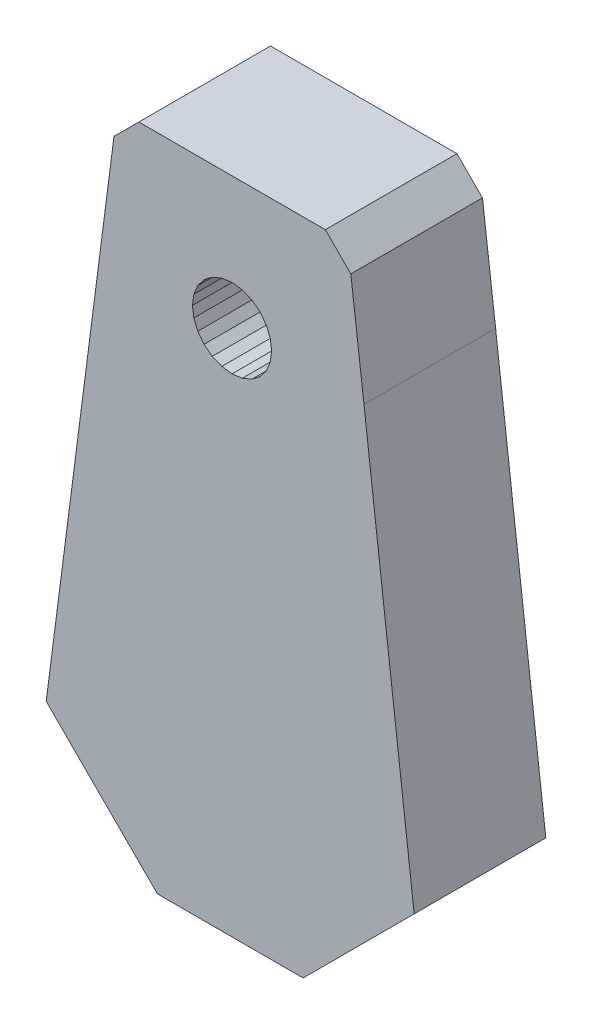
ISO-10303-21;
HEADER;
FILE_DESCRIPTION(('STEP AP214'),'2;1');
FILE_NAME('part.step','',(''),(''),'','','');
FILE_SCHEMA(('AUTOMOTIVE_DESIGN { 1 0 10303 214 1 1 1 1 }'));
ENDSEC;
DATA;
#1=APPLICATION_CONTEXT('core data for automotive mechanical design processes');
#2=APPLICATION_PROTOCOL_DEFINITION('international standard','automotive_design',2000,#1);
#3=PRODUCT_CONTEXT('',#1,'mechanical');
#4=PRODUCT('Part','Part','',(#3));
#5=PRODUCT_RELATED_PRODUCT_CATEGORY('part','',(#4));
#6=PRODUCT_DEFINITION_FORMATION('','',#4);
#7=PRODUCT_DEFINITION_CONTEXT('part definition',#1,'design');
#8=PRODUCT_DEFINITION('design','',#6,#7);
#9=PRODUCT_DEFINITION_SHAPE('','',#8);
#10=(LENGTH_UNIT() NAMED_UNIT(*) SI_UNIT(.MILLI.,.METRE.));
#11=(NAMED_UNIT(*) PLANE_ANGLE_UNIT() SI_UNIT($,.RADIAN.));
#12=(NAMED_UNIT(*) SI_UNIT($,.STERADIAN.) SOLID_ANGLE_UNIT());
#13=UNCERTAINTY_MEASURE_WITH_UNIT(LENGTH_MEASURE(1.E-05),#10,'distance_accuracy_value','');
#14=(GEOMETRIC_REPRESENTATION_CONTEXT(3) GLOBAL_UNCERTAINTY_ASSIGNED_CONTEXT((#13)) GLOBAL_UNIT_ASSIGNED_CONTEXT((#10,
#11,#12)) REPRESENTATION_CONTEXT('',''));
#15=CARTESIAN_POINT('',(0.,0.,0.));
#16=DIRECTION('',(0.,0.,1.));
#17=DIRECTION('',(1.,0.,0.));
#18=AXIS2_PLACEMENT_3D('',#15,#16,#17);
#19=CARTESIAN_POINT('',(301.525287654345,392.955405424548,6.));
#20=DIRECTION('',(0.608761429008561,0.793353340291357,0.));
#21=DIRECTION('',(-0.793353340291358,0.608761429008561,0.));
#22=AXIS2_PLACEMENT_3D('',#19,#20,#21);
#23=PLANE('',#22);
#24=DIRECTION('',(0.793353340291357,-0.608761429008561,0.));
#25=VECTOR('',#24,1.);
#26=CARTESIAN_POINT('',(301.525287654345,392.955405424548,0.));
#27=LINE('',#26,#25);
#28=CARTESIAN_POINT('',(475.222781090889,259.672630966445,0.));
#29=VERTEX_POINT('',#28);
#30=CARTESIAN_POINT('',(475.596410419264,259.385935099283,0.));
#31=VERTEX_POINT('',#30);
#32=EDGE_CURVE('E305',#29,#31,#27,.T.);
#33=ORIENTED_EDGE('',*,*,#32,.T.);
#34=DIRECTION('',(0.,0.,-1.));
#35=VECTOR('',#34,1.);
#36=CARTESIAN_POINT('',(475.596410419264,259.385935099283,6.));
#37=LINE('',#36,#35);
#38=CARTESIAN_POINT('',(475.596410419264,259.385935099283,6.));
#39=VERTEX_POINT('',#38);
#40=EDGE_CURVE('E11',#39,#31,#37,.T.);
#41=ORIENTED_EDGE('',*,*,#40,.F.);
#42=DIRECTION('',(0.793353340291357,-0.608761429008561,0.));
#43=VECTOR('',#42,1.);
#44=CARTESIAN_POINT('',(301.525287654345,392.955405424548,6.));
#45=LINE('',#44,#43);
#46=CARTESIAN_POINT('',(475.222781090889,259.672630966445,6.));
#47=VERTEX_POINT('',#46);
#48=EDGE_CURVE('E490',#47,#39,#45,.T.);
#49=ORIENTED_EDGE('',*,*,#48,.F.);
#50=DIRECTION('',(0.,0.,-1.));
#51=VECTOR('',#50,1.);
#52=CARTESIAN_POINT('',(475.222781090889,259.672630966445,6.));
#53=LINE('',#52,#51);
#54=EDGE_CURVE('E352',#47,#29,#53,.T.);
#55=ORIENTED_EDGE('',*,*,#54,.T.);
#56=EDGE_LOOP('',(#33,#41,#49,#55));
#57=FACE_BOUND('',#56,.T.);
#58=ADVANCED_FACE('F32',(#57),#23,.F.);
#59=CARTESIAN_POINT('',(424.618696453347,325.821385389105,6.));
#60=DIRECTION('',(0.79335334029123,0.608761429008727,0.));
#61=DIRECTION('',(-0.608761429008727,0.79335334029123,0.));
#62=AXIS2_PLACEMENT_3D('',#59,#60,#61);
#63=PLANE('',#62);
#64=DIRECTION('',(0.608761429008727,-0.79335334029123,0.));
#65=VECTOR('',#64,1.);
#66=CARTESIAN_POINT('',(424.618696453347,325.821385389105,0.));
#67=LINE('',#66,#65);
#68=CARTESIAN_POINT('',(475.883106286426,259.012305770908,0.));
#69=VERTEX_POINT('',#68);
#70=EDGE_CURVE('E308',#31,#69,#67,.T.);
#71=ORIENTED_EDGE('',*,*,#70,.T.);
#72=DIRECTION('',(0.,0.,-1.));
#73=VECTOR('',#72,1.);
#74=CARTESIAN_POINT('',(475.883106286426,259.012305770908,6.));
#75=LINE('',#74,#73);
#76=CARTESIAN_POINT('',(475.883106286426,259.012305770908,6.));
#77=VERTEX_POINT('',#76);
#78=EDGE_CURVE('E42',#77,#69,#75,.T.);
#79=ORIENTED_EDGE('',*,*,#78,.F.);
#80=DIRECTION('',(0.608761429008727,-0.79335334029123,0.));
#81=VECTOR('',#80,1.);
#82=CARTESIAN_POINT('',(424.618696453347,325.821385389105,6.));
#83=LINE('',#82,#81);
#84=EDGE_CURVE('E492',#39,#77,#83,.T.);
#85=ORIENTED_EDGE('',*,*,#84,.F.);
#86=ORIENTED_EDGE('',*,*,#40,.T.);
#87=EDGE_LOOP('',(#71,#79,#85,#86));
#88=FACE_BOUND('',#87,.T.);
#89=ADVANCED_FACE('F557',(#88),#63,.F.);
#90=CARTESIAN_POINT('',(497.766317807572,206.181559728233,6.));
#91=DIRECTION('',(0.923879532511405,0.382683432364805,0.));
#92=DIRECTION('',(-0.382683432364805,0.923879532511405,0.));
#93=AXIS2_PLACEMENT_3D('',#90,#91,#92);
#94=PLANE('',#93);
#95=DIRECTION('',(0.382683432364805,-0.923879532511405,0.));
#96=VECTOR('',#95,1.);
#97=CARTESIAN_POINT('',(497.766317807572,206.181559728233,0.));
#98=LINE('',#97,#96);
#99=CARTESIAN_POINT('',(476.063330842817,258.577205202597,0.));
#100=VERTEX_POINT('',#99);
#101=EDGE_CURVE('E310',#69,#100,#98,.T.);
#102=ORIENTED_EDGE('',*,*,#101,.T.);
#103=DIRECTION('',(0.,0.,-1.));
#104=VECTOR('',#103,1.);
#105=CARTESIAN_POINT('',(476.063330842817,258.577205202597,6.));
#106=LINE('',#105,#104);
#107=CARTESIAN_POINT('',(476.063330842817,258.577205202597,6.));
#108=VERTEX_POINT('',#107);
#109=EDGE_CURVE('E407',#108,#100,#106,.T.);
#110=ORIENTED_EDGE('',*,*,#109,.F.);
#111=DIRECTION('',(0.382683432364805,-0.923879532511405,0.));
#112=VECTOR('',#111,1.);
#113=CARTESIAN_POINT('',(497.766317807572,206.181559728233,6.));
#114=LINE('',#113,#112);
#115=EDGE_CURVE('E494',#77,#108,#114,.T.);
#116=ORIENTED_EDGE('',*,*,#115,.F.);
#117=ORIENTED_EDGE('',*,*,#78,.T.);
#118=EDGE_LOOP('',(#102,#110,#116,#117));
#119=FACE_BOUND('',#118,.T.);
#120=ADVANCED_FACE('F562',(#119),#94,.F.);
#121=CARTESIAN_POINT('',(501.414951194474,66.0125306525016,6.));
#122=DIRECTION('',(0.991444861373788,0.13052619222022,0.));
#123=DIRECTION('',(-0.13052619222022,0.991444861373788,0.));
#124=AXIS2_PLACEMENT_3D('',#121,#122,#123);
#125=PLANE('',#124);
#126=DIRECTION('',(0.13052619222022,-0.991444861373788,0.));
#127=VECTOR('',#126,1.);
#128=CARTESIAN_POINT('',(501.414951194474,66.0125306525016,0.));
#129=LINE('',#128,#127);
#130=CARTESIAN_POINT('',(476.124802082752,258.110284779044,0.));
#131=VERTEX_POINT('',#130);
#132=EDGE_CURVE('E312',#100,#131,#129,.T.);
#133=ORIENTED_EDGE('',*,*,#132,.T.);
#134=DIRECTION('',(0.,0.,-1.));
#135=VECTOR('',#134,1.);
#136=CARTESIAN_POINT('',(476.124802082752,258.110284779044,6.));
#137=LINE('',#136,#135);
#138=CARTESIAN_POINT('',(476.124802082752,258.110284779044,6.));
#139=VERTEX_POINT('',#138);
#140=EDGE_CURVE('E404',#139,#131,#137,.T.);
#141=ORIENTED_EDGE('',*,*,#140,.F.);
#142=DIRECTION('',(0.13052619222022,-0.991444861373788,0.));
#143=VECTOR('',#142,1.);
#144=CARTESIAN_POINT('',(501.414951194474,66.0125306525016,6.));
#145=LINE('',#144,#143);
#146=EDGE_CURVE('E496',#108,#139,#145,.T.);
#147=ORIENTED_EDGE('',*,*,#146,.F.);
#148=ORIENTED_EDGE('',*,*,#109,.T.);
#149=EDGE_LOOP('',(#133,#141,#147,#148));
#150=FACE_BOUND('',#149,.T.);
#151=ADVANCED_FACE('F653',(#150),#125,.F.);
#152=CARTESIAN_POINT('',(434.61109375672,-57.2176359723578,6.));
#153=DIRECTION('',(0.991444861373782,-0.130526192220266,0.));
#154=DIRECTION('',(0.130526192220266,0.991444861373782,0.));
#155=AXIS2_PLACEMENT_3D('',#152,#153,#154);
#156=PLANE('',#155);
#157=DIRECTION('',(-0.130526192220266,-0.991444861373782,0.));
#158=VECTOR('',#157,1.);
#159=CARTESIAN_POINT('',(434.61109375672,-57.2176359723578,0.));
#160=LINE('',#159,#158);
#161=CARTESIAN_POINT('',(476.063330842817,257.643364355491,0.));
#162=VERTEX_POINT('',#161);
#163=EDGE_CURVE('E314',#131,#162,#160,.T.);
#164=ORIENTED_EDGE('',*,*,#163,.T.);
#165=DIRECTION('',(0.,0.,-1.));
#166=VECTOR('',#165,1.);
#167=CARTESIAN_POINT('',(476.063330842817,257.643364355491,6.));
#168=LINE('',#167,#166);
#169=CARTESIAN_POINT('',(476.063330842817,257.643364355491,6.));
#170=VERTEX_POINT('',#169);
#171=EDGE_CURVE('E401',#170,#162,#168,.T.);
#172=ORIENTED_EDGE('',*,*,#171,.F.);
#173=DIRECTION('',(-0.130526192220266,-0.991444861373782,0.));
#174=VECTOR('',#173,1.);
#175=CARTESIAN_POINT('',(434.61109375672,-57.2176359723578,6.));
#176=LINE('',#175,#174);
#177=EDGE_CURVE('E498',#139,#170,#176,.T.);
#178=ORIENTED_EDGE('',*,*,#177,.F.);
#179=ORIENTED_EDGE('',*,*,#140,.T.);
#180=EDGE_LOOP('',(#164,#172,#178,#179));
#181=FACE_BOUND('',#180,.T.);
#182=ADVANCED_FACE('F649',(#181),#156,.F.);
#183=CARTESIAN_POINT('',(315.254785146361,-130.582807610575,6.));
#184=DIRECTION('',(0.923879532511353,-0.38268343236493,0.));
#185=DIRECTION('',(0.38268343236493,0.923879532511353,0.));
#186=AXIS2_PLACEMENT_3D('',#183,#184,#185);
#187=PLANE('',#186);
#188=DIRECTION('',(-0.38268343236493,-0.923879532511353,0.));
#189=VECTOR('',#188,1.);
#190=CARTESIAN_POINT('',(315.254785146361,-130.582807610575,0.));
#191=LINE('',#190,#189);
#192=CARTESIAN_POINT('',(475.883106286426,257.208263787181,0.));
#193=VERTEX_POINT('',#192);
#194=EDGE_CURVE('E316',#162,#193,#191,.T.);
#195=ORIENTED_EDGE('',*,*,#194,.T.);
#196=DIRECTION('',(0.,0.,-1.));
#197=VECTOR('',#196,1.);
#198=CARTESIAN_POINT('',(475.883106286426,257.208263787181,6.));
#199=LINE('',#198,#197);
#200=CARTESIAN_POINT('',(475.883106286426,257.208263787181,6.));
#201=VERTEX_POINT('',#200);
#202=EDGE_CURVE('E398',#201,#193,#199,.T.);
#203=ORIENTED_EDGE('',*,*,#202,.F.);
#204=DIRECTION('',(-0.38268343236493,-0.923879532511353,0.));
#205=VECTOR('',#204,1.);
#206=CARTESIAN_POINT('',(315.254785146361,-130.582807610575,6.));
#207=LINE('',#206,#205);
#208=EDGE_CURVE('E500',#170,#201,#207,.T.);
#209=ORIENTED_EDGE('',*,*,#208,.F.);
#210=ORIENTED_EDGE('',*,*,#171,.T.);
#211=EDGE_LOOP('',(#195,#203,#209,#210));
#212=FACE_BOUND('',#211,.T.);
#213=ADVANCED_FACE('F645',(#212),#187,.F.);
#214=CARTESIAN_POINT('',(175.303306354366,-134.514958047691,6.));
#215=DIRECTION('',(0.793353340291143,-0.608761429008841,0.));
#216=DIRECTION('',(0.608761429008841,0.793353340291143,0.));
#217=AXIS2_PLACEMENT_3D('',#214,#215,#216);
#218=PLANE('',#217);
#219=DIRECTION('',(-0.608761429008841,-0.793353340291143,0.));
#220=VECTOR('',#219,1.);
#221=CARTESIAN_POINT('',(175.303306354366,-134.514958047691,0.));
#222=LINE('',#221,#220);
#223=CARTESIAN_POINT('',(475.596410419264,256.834634458806,0.));
#224=VERTEX_POINT('',#223);
#225=EDGE_CURVE('E318',#193,#224,#222,.T.);
#226=ORIENTED_EDGE('',*,*,#225,.T.);
#227=DIRECTION('',(0.,0.,-1.));
#228=VECTOR('',#227,1.);
#229=CARTESIAN_POINT('',(475.596410419264,256.834634458806,6.));
#230=LINE('',#229,#228);
#231=CARTESIAN_POINT('',(475.596410419264,256.834634458806,6.));
#232=VERTEX_POINT('',#231);
#233=EDGE_CURVE('E395',#232,#224,#230,.T.);
#234=ORIENTED_EDGE('',*,*,#233,.F.);
#235=DIRECTION('',(-0.608761429008841,-0.793353340291143,0.));
#236=VECTOR('',#235,1.);
#237=CARTESIAN_POINT('',(175.303306354366,-134.514958047691,6.));
#238=LINE('',#237,#236);
#239=EDGE_CURVE('E502',#201,#232,#238,.T.);
#240=ORIENTED_EDGE('',*,*,#239,.F.);
#241=ORIENTED_EDGE('',*,*,#202,.T.);
#242=EDGE_LOOP('',(#226,#234,#240,#241));
#243=FACE_BOUND('',#242,.T.);
#244=ADVANCED_FACE('F641',(#243),#218,.F.);
#245=CARTESIAN_POINT('',(52.2098975555397,-68.0412632078213,6.));
#246=DIRECTION('',(0.60876142900871,-0.793353340291243,0.));
#247=DIRECTION('',(0.793353340291243,0.60876142900871,0.));
#248=AXIS2_PLACEMENT_3D('',#245,#246,#247);
#249=PLANE('',#248);
#250=DIRECTION('',(-0.793353340291243,-0.60876142900871,0.));
#251=VECTOR('',#250,1.);
#252=CARTESIAN_POINT('',(52.2098975555397,-68.0412632078213,0.));
#253=LINE('',#252,#251);
#254=CARTESIAN_POINT('',(475.222781090889,256.547938591644,0.));
#255=VERTEX_POINT('',#254);
#256=EDGE_CURVE('E320',#224,#255,#253,.T.);
#257=ORIENTED_EDGE('',*,*,#256,.T.);
#258=DIRECTION('',(0.,0.,-1.));
#259=VECTOR('',#258,1.);
#260=CARTESIAN_POINT('',(475.222781090889,256.547938591644,6.));
#261=LINE('',#260,#259);
#262=CARTESIAN_POINT('',(475.222781090889,256.547938591644,6.));
#263=VERTEX_POINT('',#262);
#264=EDGE_CURVE('E392',#263,#255,#261,.T.);
#265=ORIENTED_EDGE('',*,*,#264,.F.);
#266=DIRECTION('',(-0.793353340291243,-0.60876142900871,0.));
#267=VECTOR('',#266,1.);
#268=CARTESIAN_POINT('',(52.2098975555397,-68.0412632078213,6.));
#269=LINE('',#268,#267);
#270=EDGE_CURVE('E504',#232,#263,#269,.T.);
#271=ORIENTED_EDGE('',*,*,#270,.F.);
#272=ORIENTED_EDGE('',*,*,#233,.T.);
#273=EDGE_LOOP('',(#257,#265,#271,#272));
#274=FACE_BOUND('',#273,.T.);
#275=ADVANCED_FACE('F637',(#274),#249,.F.);
#276=CARTESIAN_POINT('',(-21.1086285351643,50.9607372926606,6.));
#277=DIRECTION('',(0.382683432365274,-0.923879532511211,0.));
#278=DIRECTION('',(0.923879532511211,0.382683432365274,0.));
#279=AXIS2_PLACEMENT_3D('',#276,#277,#278);
#280=PLANE('',#279);
#281=DIRECTION('',(-0.923879532511211,-0.382683432365274,0.));
#282=VECTOR('',#281,1.);
#283=CARTESIAN_POINT('',(-21.1086285351643,50.9607372926606,0.));
#284=LINE('',#283,#282);
#285=CARTESIAN_POINT('',(474.787680522578,256.367714035253,0.));
#286=VERTEX_POINT('',#285);
#287=EDGE_CURVE('E322',#255,#286,#284,.T.);
#288=ORIENTED_EDGE('',*,*,#287,.T.);
#289=DIRECTION('',(0.,0.,-1.));
#290=VECTOR('',#289,1.);
#291=CARTESIAN_POINT('',(474.787680522578,256.367714035253,6.));
#292=LINE('',#291,#290);
#293=CARTESIAN_POINT('',(474.787680522578,256.367714035253,6.));
#294=VERTEX_POINT('',#293);
#295=EDGE_CURVE('E389',#294,#286,#292,.T.);
#296=ORIENTED_EDGE('',*,*,#295,.F.);
#297=DIRECTION('',(-0.923879532511211,-0.382683432365274,0.));
#298=VECTOR('',#297,1.);
#299=CARTESIAN_POINT('',(-21.1086285351643,50.9607372926606,6.));
#300=LINE('',#299,#298);
#301=EDGE_CURVE('E506',#263,#294,#300,.T.);
#302=ORIENTED_EDGE('',*,*,#301,.F.);
#303=ORIENTED_EDGE('',*,*,#264,.T.);
#304=EDGE_LOOP('',(#288,#296,#302,#303));
#305=FACE_BOUND('',#304,.T.);
#306=ADVANCED_FACE('F633',(#305),#280,.F.);
#307=CARTESIAN_POINT('',(-25.0874245198946,190.557907974638,6.));
#308=DIRECTION('',(0.130526192220074,-0.991444861373807,0.));
#309=DIRECTION('',(0.991444861373807,0.130526192220074,0.));
#310=AXIS2_PLACEMENT_3D('',#307,#308,#309);
#311=PLANE('',#310);
#312=DIRECTION('',(-0.991444861373808,-0.130526192220074,0.));
#313=VECTOR('',#312,1.);
#314=CARTESIAN_POINT('',(-25.0874245198946,190.557907974638,0.));
#315=LINE('',#314,#313);
#316=CARTESIAN_POINT('',(474.320760099025,256.306242795318,0.));
#317=VERTEX_POINT('',#316);
#318=EDGE_CURVE('E324',#286,#317,#315,.T.);
#319=ORIENTED_EDGE('',*,*,#318,.T.);
#320=DIRECTION('',(0.,0.,-1.));
#321=VECTOR('',#320,1.);
#322=CARTESIAN_POINT('',(474.320760099025,256.306242795318,6.));
#323=LINE('',#322,#321);
#324=CARTESIAN_POINT('',(474.320760099025,256.306242795318,6.));
#325=VERTEX_POINT('',#324);
#326=EDGE_CURVE('E386',#325,#317,#323,.T.);
#327=ORIENTED_EDGE('',*,*,#326,.F.);
#328=DIRECTION('',(-0.991444861373808,-0.130526192220074,0.));
#329=VECTOR('',#328,1.);
#330=CARTESIAN_POINT('',(-25.0874245198946,190.557907974638,6.));
#331=LINE('',#330,#329);
#332=EDGE_CURVE('E508',#294,#325,#331,.T.);
#333=ORIENTED_EDGE('',*,*,#332,.F.);
#334=ORIENTED_EDGE('',*,*,#295,.T.);
#335=EDGE_LOOP('',(#319,#327,#333,#334));
#336=FACE_BOUND('',#335,.T.);
#337=ADVANCED_FACE('F629',(#336),#311,.F.);
#338=CARTESIAN_POINT('',(41.2495124942156,313.32115417579,6.));
#339=DIRECTION('',(-0.130526192220074,-0.991444861373807,0.));
#340=DIRECTION('',(0.991444861373807,-0.130526192220074,0.));
#341=AXIS2_PLACEMENT_3D('',#338,#339,#340);
#342=PLANE('',#341);
#343=DIRECTION('',(-0.991444861373808,0.130526192220074,0.));
#344=VECTOR('',#343,1.);
#345=CARTESIAN_POINT('',(41.2495124942156,313.32115417579,0.));
#346=LINE('',#345,#344);
#347=CARTESIAN_POINT('',(473.853839675472,256.367714035253,0.));
#348=VERTEX_POINT('',#347);
#349=EDGE_CURVE('E326',#317,#348,#346,.T.);
#350=ORIENTED_EDGE('',*,*,#349,.T.);
#351=DIRECTION('',(0.,0.,-1.));
#352=VECTOR('',#351,1.);
#353=CARTESIAN_POINT('',(473.853839675472,256.367714035253,6.));
#354=LINE('',#353,#352);
#355=CARTESIAN_POINT('',(473.853839675472,256.367714035253,6.));
#356=VERTEX_POINT('',#355);
#357=EDGE_CURVE('E383',#356,#348,#354,.T.);
#358=ORIENTED_EDGE('',*,*,#357,.F.);
#359=DIRECTION('',(-0.991444861373808,0.130526192220074,0.));
#360=VECTOR('',#359,1.);
#361=CARTESIAN_POINT('',(41.2495124942156,313.32115417579,6.));
#362=LINE('',#361,#360);
#363=EDGE_CURVE('E510',#325,#356,#362,.T.);
#364=ORIENTED_EDGE('',*,*,#363,.F.);
#365=ORIENTED_EDGE('',*,*,#326,.T.);
#366=EDGE_LOOP('',(#350,#358,#364,#365));
#367=FACE_BOUND('',#366,.T.);
#368=ADVANCED_FACE('F625',(#367),#342,.F.);
#369=CARTESIAN_POINT('',(160.033962710814,386.356163216393,6.));
#370=DIRECTION('',(-0.382683432365399,-0.923879532511159,0.));
#371=DIRECTION('',(0.923879532511159,-0.382683432365399,0.));
#372=AXIS2_PLACEMENT_3D('',#369,#370,#371);
#373=PLANE('',#372);
#374=DIRECTION('',(-0.923879532511159,0.382683432365399,0.));
#375=VECTOR('',#374,1.);
#376=CARTESIAN_POINT('',(160.033962710814,386.356163216393,0.));
#377=LINE('',#376,#375);
#378=CARTESIAN_POINT('',(473.418739107162,256.547938591644,0.));
#379=VERTEX_POINT('',#378);
#380=EDGE_CURVE('E328',#348,#379,#377,.T.);
#381=ORIENTED_EDGE('',*,*,#380,.T.);
#382=DIRECTION('',(0.,0.,-1.));
#383=VECTOR('',#382,1.);
#384=CARTESIAN_POINT('',(473.418739107162,256.547938591644,6.));
#385=LINE('',#384,#383);
#386=CARTESIAN_POINT('',(473.418739107162,256.547938591644,6.));
#387=VERTEX_POINT('',#386);
#388=EDGE_CURVE('E380',#387,#379,#385,.T.);
#389=ORIENTED_EDGE('',*,*,#388,.F.);
#390=DIRECTION('',(-0.923879532511159,0.382683432365399,0.));
#391=VECTOR('',#390,1.);
#392=CARTESIAN_POINT('',(160.033962710814,386.356163216393,6.));
#393=LINE('',#392,#391);
#394=EDGE_CURVE('E512',#356,#387,#393,.T.);
#395=ORIENTED_EDGE('',*,*,#394,.F.);
#396=ORIENTED_EDGE('',*,*,#357,.T.);
#397=EDGE_LOOP('',(#381,#389,#395,#396));
#398=FACE_BOUND('',#397,.T.);
#399=ADVANCED_FACE('F621',(#398),#373,.F.);
#400=CARTESIAN_POINT('',(299.347616342266,390.117408916903,6.));
#401=DIRECTION('',(-0.608761429008596,-0.793353340291331,0.));
#402=DIRECTION('',(0.793353340291331,-0.608761429008596,0.));
#403=AXIS2_PLACEMENT_3D('',#400,#401,#402);
#404=PLANE('',#403);
#405=DIRECTION('',(-0.793353340291331,0.608761429008596,0.));
#406=VECTOR('',#405,1.);
#407=CARTESIAN_POINT('',(299.347616342266,390.117408916903,0.));
#408=LINE('',#407,#406);
#409=CARTESIAN_POINT('',(473.045109778787,256.834634458806,0.));
#410=VERTEX_POINT('',#409);
#411=EDGE_CURVE('E330',#379,#410,#408,.T.);
#412=ORIENTED_EDGE('',*,*,#411,.T.);
#413=DIRECTION('',(0.,0.,-1.));
#414=VECTOR('',#413,1.);
#415=CARTESIAN_POINT('',(473.045109778787,256.834634458806,6.));
#416=LINE('',#415,#414);
#417=CARTESIAN_POINT('',(473.045109778787,256.834634458806,6.));
#418=VERTEX_POINT('',#417);
#419=EDGE_CURVE('E377',#418,#410,#416,.T.);
#420=ORIENTED_EDGE('',*,*,#419,.F.);
#421=DIRECTION('',(-0.793353340291331,0.608761429008596,0.));
#422=VECTOR('',#421,1.);
#423=CARTESIAN_POINT('',(299.347616342266,390.117408916903,6.));
#424=LINE('',#423,#422);
#425=EDGE_CURVE('E514',#387,#418,#424,.T.);
#426=ORIENTED_EDGE('',*,*,#425,.F.);
#427=ORIENTED_EDGE('',*,*,#388,.T.);
#428=EDGE_LOOP('',(#412,#420,#426,#427));
#429=FACE_BOUND('',#428,.T.);
#430=ADVANCED_FACE('F617',(#429),#404,.F.);
#431=CARTESIAN_POINT('',(421.780699945646,323.643714077062,6.));
#432=DIRECTION('',(-0.793353340291133,-0.608761429008853,0.));
#433=DIRECTION('',(0.608761429008853,-0.793353340291134,0.));
#434=AXIS2_PLACEMENT_3D('',#431,#432,#433);
#435=PLANE('',#434);
#436=DIRECTION('',(-0.608761429008853,0.793353340291134,0.));
#437=VECTOR('',#436,1.);
#438=CARTESIAN_POINT('',(421.780699945646,323.643714077062,0.));
#439=LINE('',#438,#437);
#440=CARTESIAN_POINT('',(472.758413911624,257.208263787181,0.));
#441=VERTEX_POINT('',#440);
#442=EDGE_CURVE('E332',#410,#441,#439,.T.);
#443=ORIENTED_EDGE('',*,*,#442,.T.);
#444=DIRECTION('',(0.,0.,-1.));
#445=VECTOR('',#444,1.);
#446=CARTESIAN_POINT('',(472.758413911624,257.208263787181,6.));
#447=LINE('',#446,#445);
#448=CARTESIAN_POINT('',(472.758413911624,257.208263787181,6.));
#449=VERTEX_POINT('',#448);
#450=EDGE_CURVE('E374',#449,#441,#447,.T.);
#451=ORIENTED_EDGE('',*,*,#450,.F.);
#452=DIRECTION('',(-0.608761429008853,0.793353340291134,0.));
#453=VECTOR('',#452,1.);
#454=CARTESIAN_POINT('',(421.780699945646,323.643714077062,6.));
#455=LINE('',#454,#453);
#456=EDGE_CURVE('E516',#418,#449,#455,.T.);
#457=ORIENTED_EDGE('',*,*,#456,.F.);
#458=ORIENTED_EDGE('',*,*,#419,.T.);
#459=EDGE_LOOP('',(#443,#451,#457,#458));
#460=FACE_BOUND('',#459,.T.);
#461=ADVANCED_FACE('F613',(#460),#435,.F.);
#462=CARTESIAN_POINT('',(494.46140087639,204.812618312779,6.));
#463=DIRECTION('',(-0.923879532511433,-0.382683432364736,0.));
#464=DIRECTION('',(0.382683432364736,-0.923879532511433,0.));
#465=AXIS2_PLACEMENT_3D('',#462,#463,#464);
#466=PLANE('',#465);
#467=DIRECTION('',(-0.382683432364736,0.923879532511433,0.));
#468=VECTOR('',#467,1.);
#469=CARTESIAN_POINT('',(494.46140087639,204.812618312779,0.));
#470=LINE('',#469,#468);
#471=CARTESIAN_POINT('',(472.578189355234,257.643364355491,0.));
#472=VERTEX_POINT('',#471);
#473=EDGE_CURVE('E334',#441,#472,#470,.T.);
#474=ORIENTED_EDGE('',*,*,#473,.T.);
#475=DIRECTION('',(0.,0.,-1.));
#476=VECTOR('',#475,1.);
#477=CARTESIAN_POINT('',(472.578189355234,257.643364355491,6.));
#478=LINE('',#477,#476);
#479=CARTESIAN_POINT('',(472.578189355234,257.643364355491,6.));
#480=VERTEX_POINT('',#479);
#481=EDGE_CURVE('E371',#480,#472,#478,.T.);
#482=ORIENTED_EDGE('',*,*,#481,.F.);
#483=DIRECTION('',(-0.382683432364736,0.923879532511433,0.));
#484=VECTOR('',#483,1.);
#485=CARTESIAN_POINT('',(494.46140087639,204.812618312779,6.));
#486=LINE('',#485,#484);
#487=EDGE_CURVE('E518',#449,#480,#486,.T.);
#488=ORIENTED_EDGE('',*,*,#487,.F.);
#489=ORIENTED_EDGE('',*,*,#450,.T.);
#490=EDGE_LOOP('',(#474,#482,#488,#489));
#491=FACE_BOUND('',#490,.T.);
#492=ADVANCED_FACE('F609',(#491),#466,.F.);
#493=CARTESIAN_POINT('',(497.868338466932,65.5456102288499,6.));
#494=DIRECTION('',(-0.991444861373812,-0.130526192220034,0.));
#495=DIRECTION('',(0.130526192220035,-0.991444861373813,0.));
#496=AXIS2_PLACEMENT_3D('',#493,#494,#495);
#497=PLANE('',#496);
#498=DIRECTION('',(-0.130526192220035,0.991444861373813,0.));
#499=VECTOR('',#498,1.);
#500=CARTESIAN_POINT('',(497.868338466932,65.5456102288499,0.));
#501=LINE('',#500,#499);
#502=CARTESIAN_POINT('',(472.516718115299,258.110284779044,0.));
#503=VERTEX_POINT('',#502);
#504=EDGE_CURVE('E336',#472,#503,#501,.T.);
#505=ORIENTED_EDGE('',*,*,#504,.T.);
#506=DIRECTION('',(0.,0.,-1.));
#507=VECTOR('',#506,1.);
#508=CARTESIAN_POINT('',(472.516718115299,258.110284779044,6.));
#509=LINE('',#508,#507);
#510=CARTESIAN_POINT('',(472.516718115299,258.110284779044,6.));
#511=VERTEX_POINT('',#510);
#512=EDGE_CURVE('E368',#511,#503,#509,.T.);
#513=ORIENTED_EDGE('',*,*,#512,.F.);
#514=DIRECTION('',(-0.130526192220035,0.991444861373813,0.));
#515=VECTOR('',#514,1.);
#516=CARTESIAN_POINT('',(497.868338466932,65.5456102288499,6.));
#517=LINE('',#516,#515);
#518=EDGE_CURVE('E520',#480,#511,#517,.T.);
#519=ORIENTED_EDGE('',*,*,#518,.F.);
#520=ORIENTED_EDGE('',*,*,#481,.T.);
#521=EDGE_LOOP('',(#505,#513,#519,#520));
#522=FACE_BOUND('',#521,.T.);
#523=ADVANCED_FACE('F605',(#522),#497,.F.);
#524=CARTESIAN_POINT('',(431.064481029341,-56.750715548659,6.));
#525=DIRECTION('',(-0.991444861373831,0.130526192219897,0.));
#526=DIRECTION('',(-0.130526192219897,-0.991444861373831,0.));
#527=AXIS2_PLACEMENT_3D('',#524,#525,#526);
#528=PLANE('',#527);
#529=DIRECTION('',(0.130526192219897,0.991444861373831,0.));
#530=VECTOR('',#529,1.);
#531=CARTESIAN_POINT('',(431.064481029341,-56.750715548659,0.));
#532=LINE('',#531,#530);
#533=CARTESIAN_POINT('',(472.578189355234,258.577205202597,0.));
#534=VERTEX_POINT('',#533);
#535=EDGE_CURVE('E338',#503,#534,#532,.T.);
#536=ORIENTED_EDGE('',*,*,#535,.T.);
#537=DIRECTION('',(0.,0.,-1.));
#538=VECTOR('',#537,1.);
#539=CARTESIAN_POINT('',(472.578189355234,258.577205202597,6.));
#540=LINE('',#539,#538);
#541=CARTESIAN_POINT('',(472.578189355234,258.577205202597,6.));
#542=VERTEX_POINT('',#541);
#543=EDGE_CURVE('E365',#542,#534,#540,.T.);
#544=ORIENTED_EDGE('',*,*,#543,.F.);
#545=DIRECTION('',(0.130526192219897,0.991444861373831,0.));
#546=VECTOR('',#545,1.);
#547=CARTESIAN_POINT('',(431.064481029341,-56.750715548659,6.));
#548=LINE('',#547,#546);
#549=EDGE_CURVE('E522',#511,#542,#548,.T.);
#550=ORIENTED_EDGE('',*,*,#549,.F.);
#551=ORIENTED_EDGE('',*,*,#512,.T.);
#552=EDGE_LOOP('',(#536,#544,#550,#551));
#553=FACE_BOUND('',#552,.T.);
#554=ADVANCED_FACE('F601',(#553),#528,.F.);
#555=CARTESIAN_POINT('',(311.949868215324,-129.213866195114,6.));
#556=DIRECTION('',(-0.923879532511468,0.382683432364653,0.));
#557=DIRECTION('',(-0.382683432364653,-0.923879532511468,0.));
#558=AXIS2_PLACEMENT_3D('',#555,#556,#557);
#559=PLANE('',#558);
#560=DIRECTION('',(0.382683432364653,0.923879532511468,0.));
#561=VECTOR('',#560,1.);
#562=CARTESIAN_POINT('',(311.949868215324,-129.213866195114,0.));
#563=LINE('',#562,#561);
#564=CARTESIAN_POINT('',(472.758413911624,259.012305770908,0.));
#565=VERTEX_POINT('',#564);
#566=EDGE_CURVE('E340',#534,#565,#563,.T.);
#567=ORIENTED_EDGE('',*,*,#566,.T.);
#568=DIRECTION('',(0.,0.,-1.));
#569=VECTOR('',#568,1.);
#570=CARTESIAN_POINT('',(472.758413911624,259.012305770908,6.));
#571=LINE('',#570,#569);
#572=CARTESIAN_POINT('',(472.758413911624,259.012305770908,6.));
#573=VERTEX_POINT('',#572);
#574=EDGE_CURVE('E362',#573,#565,#571,.T.);
#575=ORIENTED_EDGE('',*,*,#574,.F.);
#576=DIRECTION('',(0.382683432364653,0.923879532511468,0.));
#577=VECTOR('',#576,1.);
#578=CARTESIAN_POINT('',(311.949868215324,-129.213866195114,6.));
#579=LINE('',#578,#577);
#580=EDGE_CURVE('E524',#542,#573,#579,.T.);
#581=ORIENTED_EDGE('',*,*,#580,.F.);
#582=ORIENTED_EDGE('',*,*,#543,.T.);
#583=EDGE_LOOP('',(#567,#575,#581,#582));
#584=FACE_BOUND('',#583,.T.);
#585=ADVANCED_FACE('F597',(#584),#559,.F.);
#586=CARTESIAN_POINT('',(172.465309846606,-132.337286735559,6.));
#587=DIRECTION('',(-0.793353340291002,0.608761429009024,0.));
#588=DIRECTION('',(-0.608761429009024,-0.793353340291003,0.));
#589=AXIS2_PLACEMENT_3D('',#586,#587,#588);
#590=PLANE('',#589);
#591=DIRECTION('',(0.608761429009024,0.793353340291003,0.));
#592=VECTOR('',#591,1.);
#593=CARTESIAN_POINT('',(172.465309846606,-132.337286735559,0.));
#594=LINE('',#593,#592);
#595=CARTESIAN_POINT('',(473.045109778787,259.385935099283,0.));
#596=VERTEX_POINT('',#595);
#597=EDGE_CURVE('E342',#565,#596,#594,.T.);
#598=ORIENTED_EDGE('',*,*,#597,.T.);
#599=DIRECTION('',(0.,0.,-1.));
#600=VECTOR('',#599,1.);
#601=CARTESIAN_POINT('',(473.045109778787,259.385935099283,6.));
#602=LINE('',#601,#600);
#603=CARTESIAN_POINT('',(473.045109778787,259.385935099283,6.));
#604=VERTEX_POINT('',#603);
#605=EDGE_CURVE('E359',#604,#596,#602,.T.);
#606=ORIENTED_EDGE('',*,*,#605,.F.);
#607=DIRECTION('',(0.608761429009024,0.793353340291003,0.));
#608=VECTOR('',#607,1.);
#609=CARTESIAN_POINT('',(172.465309846606,-132.337286735559,6.));
#610=LINE('',#609,#608);
#611=EDGE_CURVE('E526',#573,#604,#610,.T.);
#612=ORIENTED_EDGE('',*,*,#611,.F.);
#613=ORIENTED_EDGE('',*,*,#574,.T.);
#614=EDGE_LOOP('',(#598,#606,#612,#613));
#615=FACE_BOUND('',#614,.T.);
#616=ADVANCED_FACE('F594',(#615),#590,.F.);
#617=CARTESIAN_POINT('',(50.0322262433093,-65.2032667000588,6.));
#618=DIRECTION('',(-0.608761429008448,0.793353340291445,0.));
#619=DIRECTION('',(-0.793353340291445,-0.608761429008448,0.));
#620=AXIS2_PLACEMENT_3D('',#617,#618,#619);
#621=PLANE('',#620);
#622=DIRECTION('',(0.793353340291445,0.608761429008448,0.));
#623=VECTOR('',#622,1.);
#624=CARTESIAN_POINT('',(50.0322262433093,-65.2032667000588,0.));
#625=LINE('',#624,#623);
#626=CARTESIAN_POINT('',(473.418739107162,259.672630966445,0.));
#627=VERTEX_POINT('',#626);
#628=EDGE_CURVE('E344',#596,#627,#625,.T.);
#629=ORIENTED_EDGE('',*,*,#628,.T.);
#630=DIRECTION('',(0.,0.,-1.));
#631=VECTOR('',#630,1.);
#632=CARTESIAN_POINT('',(473.418739107162,259.672630966445,6.));
#633=LINE('',#632,#631);
#634=CARTESIAN_POINT('',(473.418739107162,259.672630966445,6.));
#635=VERTEX_POINT('',#634);
#636=EDGE_CURVE('E356',#635,#627,#633,.T.);
#637=ORIENTED_EDGE('',*,*,#636,.F.);
#638=DIRECTION('',(0.793353340291445,0.608761429008448,0.));
#639=VECTOR('',#638,1.);
#640=CARTESIAN_POINT('',(50.0322262433093,-65.2032667000588,6.));
#641=LINE('',#640,#639);
#642=EDGE_CURVE('E528',#604,#635,#641,.T.);
#643=ORIENTED_EDGE('',*,*,#642,.F.);
#644=ORIENTED_EDGE('',*,*,#605,.T.);
#645=EDGE_LOOP('',(#629,#637,#643,#644));
#646=FACE_BOUND('',#645,.T.);
#647=ADVANCED_FACE('F534',(#646),#621,.F.);
#648=CARTESIAN_POINT('',(-22.4775699506101,54.2656542239516,6.));
#649=DIRECTION('',(-0.382683432365097,0.923879532511284,0.));
#650=DIRECTION('',(-0.923879532511284,-0.382683432365097,0.));
#651=AXIS2_PLACEMENT_3D('',#648,#649,#650);
#652=PLANE('',#651);
#653=DIRECTION('',(0.923879532511284,0.382683432365097,0.));
#654=VECTOR('',#653,1.);
#655=CARTESIAN_POINT('',(-22.4775699506101,54.2656542239516,0.));
#656=LINE('',#655,#654);
#657=CARTESIAN_POINT('',(473.853839675472,259.852855522836,0.));
#658=VERTEX_POINT('',#657);
#659=EDGE_CURVE('E346',#627,#658,#656,.T.);
#660=ORIENTED_EDGE('',*,*,#659,.T.);
#661=DIRECTION('',(0.,0.,-1.));
#662=VECTOR('',#661,1.);
#663=CARTESIAN_POINT('',(473.853839675472,259.852855522836,6.));
#664=LINE('',#663,#662);
#665=CARTESIAN_POINT('',(473.853839675472,259.852855522836,6.));
#666=VERTEX_POINT('',#665);
#667=EDGE_CURVE('E273',#666,#658,#664,.T.);
#668=ORIENTED_EDGE('',*,*,#667,.F.);
#669=DIRECTION('',(0.923879532511284,0.382683432365097,0.));
#670=VECTOR('',#669,1.);
#671=CARTESIAN_POINT('',(-22.4775699506101,54.2656542239516,6.));
#672=LINE('',#671,#670);
#673=EDGE_CURVE('E264',#635,#666,#672,.T.);
#674=ORIENTED_EDGE('',*,*,#673,.F.);
#675=ORIENTED_EDGE('',*,*,#636,.T.);
#676=EDGE_LOOP('',(#660,#668,#674,#675));
#677=FACE_BOUND('',#676,.T.);
#678=ADVANCED_FACE('F538',(#677),#652,.F.);
#679=CARTESIAN_POINT('',(-25.5543449434627,194.104520702095,6.));
#680=DIRECTION('',(-0.13052619222019,0.991444861373792,0.));
#681=DIRECTION('',(-0.991444861373792,-0.13052619222019,0.));
#682=AXIS2_PLACEMENT_3D('',#679,#680,#681);
#683=PLANE('',#682);
#684=DIRECTION('',(0.991444861373792,0.13052619222019,0.));
#685=VECTOR('',#684,1.);
#686=CARTESIAN_POINT('',(-25.5543449434627,194.104520702095,0.));
#687=LINE('',#686,#685);
#688=CARTESIAN_POINT('',(474.320760099025,259.914326762771,0.));
#689=VERTEX_POINT('',#688);
#690=EDGE_CURVE('E272',#658,#689,#687,.T.);
#691=ORIENTED_EDGE('',*,*,#690,.T.);
#692=DIRECTION('',(0.,0.,-1.));
#693=VECTOR('',#692,1.);
#694=CARTESIAN_POINT('',(474.320760099025,259.914326762771,6.));
#695=LINE('',#694,#693);
#696=CARTESIAN_POINT('',(474.320760099025,259.914326762771,6.));
#697=VERTEX_POINT('',#696);
#698=EDGE_CURVE('E269',#697,#689,#695,.T.);
#699=ORIENTED_EDGE('',*,*,#698,.F.);
#700=DIRECTION('',(0.991444861373792,0.13052619222019,0.));
#701=VECTOR('',#700,1.);
#702=CARTESIAN_POINT('',(-25.5543449434627,194.104520702095,6.));
#703=LINE('',#702,#701);
#704=EDGE_CURVE('E258',#666,#697,#703,.T.);
#705=ORIENTED_EDGE('',*,*,#704,.F.);
#706=ORIENTED_EDGE('',*,*,#667,.T.);
#707=EDGE_LOOP('',(#691,#699,#705,#706));
#708=FACE_BOUND('',#707,.T.);
#709=ADVANCED_FACE('F270',(#708),#683,.F.);
#710=CARTESIAN_POINT('',(41.7164329178123,316.867766903354,6.));
#711=DIRECTION('',(0.13052619222019,0.991444861373792,0.));
#712=DIRECTION('',(-0.991444861373792,0.13052619222019,0.));
#713=AXIS2_PLACEMENT_3D('',#710,#711,#712);
#714=PLANE('',#713);
#715=DIRECTION('',(0.991444861373792,-0.13052619222019,0.));
#716=VECTOR('',#715,1.);
#717=CARTESIAN_POINT('',(41.7164329178123,316.867766903354,0.));
#718=LINE('',#717,#716);
#719=CARTESIAN_POINT('',(474.787680522578,259.852855522836,0.));
#720=VERTEX_POINT('',#719);
#721=EDGE_CURVE('E155',#689,#720,#718,.T.);
#722=ORIENTED_EDGE('',*,*,#721,.T.);
#723=DIRECTION('',(0.,0.,-1.));
#724=VECTOR('',#723,1.);
#725=CARTESIAN_POINT('',(474.787680522578,259.852855522836,6.));
#726=LINE('',#725,#724);
#727=CARTESIAN_POINT('',(474.787680522578,259.852855522836,6.));
#728=VERTEX_POINT('',#727);
#729=EDGE_CURVE('E274',#728,#720,#726,.T.);
#730=ORIENTED_EDGE('',*,*,#729,.F.);
#731=DIRECTION('',(0.991444861373792,-0.13052619222019,0.));
#732=VECTOR('',#731,1.);
#733=CARTESIAN_POINT('',(41.7164329178123,316.867766903354,6.));
#734=LINE('',#733,#732);
#735=EDGE_CURVE('E262',#697,#728,#734,.T.);
#736=ORIENTED_EDGE('',*,*,#735,.F.);
#737=ORIENTED_EDGE('',*,*,#698,.T.);
#738=EDGE_LOOP('',(#722,#730,#736,#737));
#739=FACE_BOUND('',#738,.T.);
#740=ADVANCED_FACE('F276',(#739),#714,.F.);
#741=CARTESIAN_POINT('',(427.669854028824,-55.4296394410153,6.));
#742=DIRECTION('',(-0.991705180475739,0.128533400396869,0.));
#743=DIRECTION('',(-0.128533400396869,-0.991705180475739,0.));
#744=AXIS2_PLACEMENT_3D('',#741,#742,#743);
#745=PLANE('',#744);
#746=DIRECTION('',(0.128533400396869,0.991705180475739,0.));
#747=VECTOR('',#746,1.);
#748=CARTESIAN_POINT('',(427.669854028824,-55.4296394410153,0.));
#749=LINE('',#748,#747);
#750=CARTESIAN_POINT('',(465.849271947132,239.145361455456,0.));
#751=VERTEX_POINT('',#750);
#752=CARTESIAN_POINT('',(468.93995892763,262.991694628974,0.));
#753=VERTEX_POINT('',#752);
#754=EDGE_CURVE('E282',#751,#753,#749,.T.);
#755=ORIENTED_EDGE('',*,*,#754,.F.);
#756=DIRECTION('',(0.,0.,-1.));
#757=VECTOR('',#756,1.);
#758=CARTESIAN_POINT('',(465.849271947132,239.145361455456,6.));
#759=LINE('',#758,#757);
#760=CARTESIAN_POINT('',(465.849271947132,239.145361455456,6.));
#761=VERTEX_POINT('',#760);
#762=EDGE_CURVE('E36',#761,#751,#759,.T.);
#763=ORIENTED_EDGE('',*,*,#762,.F.);
#764=DIRECTION('',(0.128533400396869,0.991705180475739,0.));
#765=VECTOR('',#764,1.);
#766=CARTESIAN_POINT('',(427.669854028824,-55.4296394410153,6.));
#767=LINE('',#766,#765);
#768=CARTESIAN_POINT('',(468.93995892763,262.991694628974,6.));
#769=VERTEX_POINT('',#768);
#770=EDGE_CURVE('E351',#761,#769,#767,.T.);
#771=ORIENTED_EDGE('',*,*,#770,.T.);
#772=DIRECTION('',(0.,0.,-1.));
#773=VECTOR('',#772,1.);
#774=CARTESIAN_POINT('',(468.93995892763,262.991694628974,6.));
#775=LINE('',#774,#773);
#776=EDGE_CURVE('E278',#769,#753,#775,.T.);
#777=ORIENTED_EDGE('',*,*,#776,.T.);
#778=EDGE_LOOP('',(#755,#763,#771,#777));
#779=FACE_BOUND('',#778,.T.);
#780=ADVANCED_FACE('F34',(#779),#745,.T.);
#781=CARTESIAN_POINT('',(352.497316701316,352.497316701283,6.));
#782=DIRECTION('',(0.70710678118658,0.707106781186514,0.));
#783=DIRECTION('',(-0.707106781186515,0.707106781186581,0.));
#784=AXIS2_PLACEMENT_3D('',#781,#782,#783);
#785=PLANE('',#784);
#786=DIRECTION('',(0.707106781186515,-0.707106781186581,0.));
#787=VECTOR('',#786,1.);
#788=CARTESIAN_POINT('',(352.497316701316,352.497316701283,0.));
#789=LINE('',#788,#787);
#790=CARTESIAN_POINT('',(470.917430059776,234.077203342812,0.));
#791=VERTEX_POINT('',#790);
#792=EDGE_CURVE('E285',#751,#791,#789,.T.);
#793=ORIENTED_EDGE('',*,*,#792,.T.);
#794=DIRECTION('',(0.,0.,-1.));
#795=VECTOR('',#794,1.);
#796=CARTESIAN_POINT('',(470.917430059776,234.077203342812,6.));
#797=LINE('',#796,#795);
#798=CARTESIAN_POINT('',(470.917430059776,234.077203342812,6.));
#799=VERTEX_POINT('',#798);
#800=EDGE_CURVE('E427',#799,#791,#797,.T.);
#801=ORIENTED_EDGE('',*,*,#800,.F.);
#802=DIRECTION('',(0.707106781186515,-0.707106781186581,0.));
#803=VECTOR('',#802,1.);
#804=CARTESIAN_POINT('',(352.497316701316,352.497316701283,6.));
#805=LINE('',#804,#803);
#806=EDGE_CURVE('E436',#761,#799,#805,.T.);
#807=ORIENTED_EDGE('',*,*,#806,.F.);
#808=ORIENTED_EDGE('',*,*,#762,.T.);
#809=EDGE_LOOP('',(#793,#801,#807,#808));
#810=FACE_BOUND('',#809,.T.);
#811=ADVANCED_FACE('F435',(#810),#785,.F.);
#812=CARTESIAN_POINT('',(0.,234.077203342812,6.));
#813=DIRECTION('',(0.,1.,0.));
#814=DIRECTION('',(0.,0.,1.));
#815=AXIS2_PLACEMENT_3D('',#812,#813,#814);
#816=PLANE('',#815);
#817=DIRECTION('',(1.,0.,0.));
#818=VECTOR('',#817,1.);
#819=CARTESIAN_POINT('',(0.,234.077203342812,0.));
#820=LINE('',#819,#818);
#821=CARTESIAN_POINT('',(477.559378835436,234.077203342812,0.));
#822=VERTEX_POINT('',#821);
#823=EDGE_CURVE('E287',#791,#822,#820,.T.);
#824=ORIENTED_EDGE('',*,*,#823,.T.);
#825=DIRECTION('',(0.,0.,-1.));
#826=VECTOR('',#825,1.);
#827=CARTESIAN_POINT('',(477.559378835436,234.077203342812,6.));
#828=LINE('',#827,#826);
#829=CARTESIAN_POINT('',(477.559378835436,234.077203342812,6.));
#830=VERTEX_POINT('',#829);
#831=EDGE_CURVE('E425',#830,#822,#828,.T.);
#832=ORIENTED_EDGE('',*,*,#831,.F.);
#833=DIRECTION('',(1.,0.,0.));
#834=VECTOR('',#833,1.);
#835=CARTESIAN_POINT('',(0.,234.077203342812,6.));
#836=LINE('',#835,#834);
#837=EDGE_CURVE('E476',#799,#830,#836,.T.);
#838=ORIENTED_EDGE('',*,*,#837,.F.);
#839=ORIENTED_EDGE('',*,*,#800,.T.);
#840=EDGE_LOOP('',(#824,#832,#838,#839));
#841=FACE_BOUND('',#840,.T.);
#842=ADVANCED_FACE('F475',(#841),#816,.F.);
#843=CARTESIAN_POINT('',(121.741087746319,-121.741087746315,6.));
#844=DIRECTION('',(-0.707106781186557,0.707106781186538,0.));
#845=DIRECTION('',(-0.707106781186538,-0.707106781186557,0.));
#846=AXIS2_PLACEMENT_3D('',#843,#844,#845);
#847=PLANE('',#846);
#848=DIRECTION('',(0.707106781186538,0.707106781186557,0.));
#849=VECTOR('',#848,1.);
#850=CARTESIAN_POINT('',(121.741087746319,-121.741087746315,0.));
#851=LINE('',#850,#849);
#852=CARTESIAN_POINT('',(482.62224434738,239.140068854756,0.));
#853=VERTEX_POINT('',#852);
#854=EDGE_CURVE('E289',#822,#853,#851,.T.);
#855=ORIENTED_EDGE('',*,*,#854,.T.);
#856=DIRECTION('',(0.,0.,-1.));
#857=VECTOR('',#856,1.);
#858=CARTESIAN_POINT('',(482.62224434738,239.140068854756,6.));
#859=LINE('',#858,#857);
#860=CARTESIAN_POINT('',(482.62224434738,239.140068854756,6.));
#861=VERTEX_POINT('',#860);
#862=EDGE_CURVE('E422',#861,#853,#859,.T.);
#863=ORIENTED_EDGE('',*,*,#862,.F.);
#864=DIRECTION('',(0.707106781186538,0.707106781186557,0.));
#865=VECTOR('',#864,1.);
#866=CARTESIAN_POINT('',(121.741087746319,-121.741087746315,6.));
#867=LINE('',#866,#865);
#868=EDGE_CURVE('E473',#830,#861,#867,.T.);
#869=ORIENTED_EDGE('',*,*,#868,.F.);
#870=ORIENTED_EDGE('',*,*,#831,.T.);
#871=EDGE_LOOP('',(#855,#863,#869,#870));
#872=FACE_BOUND('',#871,.T.);
#873=ADVANCED_FACE('F472',(#872),#847,.F.);
#874=CARTESIAN_POINT('',(504.131523617288,60.8036545600081,6.));
#875=DIRECTION('',(-0.992804935017255,-0.119742895427598,0.));
#876=DIRECTION('',(0.119742895427598,-0.992804935017255,0.));
#877=AXIS2_PLACEMENT_3D('',#874,#875,#876);
#878=PLANE('',#877);
#879=DIRECTION('',(-0.119742895427598,0.992804935017255,0.));
#880=VECTOR('',#879,1.);
#881=CARTESIAN_POINT('',(504.131523617288,60.8036545600081,0.));
#882=LINE('',#881,#880);
#883=CARTESIAN_POINT('',(480.334233378114,258.110284779044,0.));
#884=VERTEX_POINT('',#883);
#885=EDGE_CURVE('E291',#853,#884,#882,.T.);
#886=ORIENTED_EDGE('',*,*,#885,.T.);
#887=DIRECTION('',(0.,0.,-1.));
#888=VECTOR('',#887,1.);
#889=CARTESIAN_POINT('',(480.334233378114,258.110284779044,6.));
#890=LINE('',#889,#888);
#891=CARTESIAN_POINT('',(480.334233378114,258.110284779044,6.));
#892=VERTEX_POINT('',#891);
#893=EDGE_CURVE('E419',#892,#884,#890,.T.);
#894=ORIENTED_EDGE('',*,*,#893,.F.);
#895=DIRECTION('',(-0.119742895427598,0.992804935017255,0.));
#896=VECTOR('',#895,1.);
#897=CARTESIAN_POINT('',(504.131523617288,60.8036545600081,6.));
#898=LINE('',#897,#896);
#899=EDGE_CURVE('E469',#861,#892,#898,.T.);
#900=ORIENTED_EDGE('',*,*,#899,.F.);
#901=ORIENTED_EDGE('',*,*,#862,.T.);
#902=EDGE_LOOP('',(#886,#894,#900,#901));
#903=FACE_BOUND('',#902,.T.);
#904=ADVANCED_FACE('F466',(#903),#878,.F.);
#905=CARTESIAN_POINT('',(504.511712558352,62.2913172248848,6.));
#906=DIRECTION('',(-0.99246381685378,-0.122538044035417,0.));
#907=DIRECTION('',(0.122538044035417,-0.99246381685378,0.));
#908=AXIS2_PLACEMENT_3D('',#905,#906,#907);
#909=PLANE('',#908);
#910=DIRECTION('',(-0.122538044035417,0.99246381685378,0.));
#911=VECTOR('',#910,1.);
#912=CARTESIAN_POINT('',(504.511712558352,62.2913172248848,0.));
#913=LINE('',#912,#911);
#914=CARTESIAN_POINT('',(479.73539911199,262.960381302931,0.));
#915=VERTEX_POINT('',#914);
#916=EDGE_CURVE('E293',#884,#915,#913,.T.);
#917=ORIENTED_EDGE('',*,*,#916,.T.);
#918=DIRECTION('',(0.,0.,-1.));
#919=VECTOR('',#918,1.);
#920=CARTESIAN_POINT('',(479.73539911199,262.960381302931,6.));
#921=LINE('',#920,#919);
#922=CARTESIAN_POINT('',(479.73539911199,262.960381302931,6.));
#923=VERTEX_POINT('',#922);
#924=EDGE_CURVE('E417',#923,#915,#921,.T.);
#925=ORIENTED_EDGE('',*,*,#924,.F.);
#926=DIRECTION('',(-0.122538044035417,0.99246381685378,0.));
#927=VECTOR('',#926,1.);
#928=CARTESIAN_POINT('',(504.511712558352,62.2913172248848,6.));
#929=LINE('',#928,#927);
#930=EDGE_CURVE('E484',#892,#923,#929,.T.);
#931=ORIENTED_EDGE('',*,*,#930,.F.);
#932=ORIENTED_EDGE('',*,*,#893,.T.);
#933=EDGE_LOOP('',(#917,#925,#931,#932));
#934=FACE_BOUND('',#933,.T.);
#935=ADVANCED_FACE('F462',(#934),#909,.F.);
#936=CARTESIAN_POINT('',(371.347890207506,371.347890207435,6.));
#937=DIRECTION('',(0.707106781186615,0.70710678118648,0.));
#938=DIRECTION('',(-0.70710678118648,0.707106781186615,0.));
#939=AXIS2_PLACEMENT_3D('',#936,#937,#938);
#940=PLANE('',#939);
#941=DIRECTION('',(0.70710678118648,-0.707106781186615,0.));
#942=VECTOR('',#941,1.);
#943=CARTESIAN_POINT('',(371.347890207506,371.347890207435,0.));
#944=LINE('',#943,#942);
#945=CARTESIAN_POINT('',(478.572022356789,264.123758058133,0.));
#946=VERTEX_POINT('',#945);
#947=EDGE_CURVE('E296',#946,#915,#944,.T.);
#948=ORIENTED_EDGE('',*,*,#947,.F.);
#949=DIRECTION('',(0.,0.,-1.));
#950=VECTOR('',#949,1.);
#951=CARTESIAN_POINT('',(478.572022356789,264.123758058133,6.));
#952=LINE('',#951,#950);
#953=CARTESIAN_POINT('',(478.572022356789,264.123758058133,6.));
#954=VERTEX_POINT('',#953);
#955=EDGE_CURVE('E415',#954,#946,#952,.T.);
#956=ORIENTED_EDGE('',*,*,#955,.F.);
#957=DIRECTION('',(0.70710678118648,-0.707106781186615,0.));
#958=VECTOR('',#957,1.);
#959=CARTESIAN_POINT('',(371.347890207506,371.347890207435,6.));
#960=LINE('',#959,#958);
#961=EDGE_CURVE('E459',#954,#923,#960,.T.);
#962=ORIENTED_EDGE('',*,*,#961,.T.);
#963=ORIENTED_EDGE('',*,*,#924,.T.);
#964=EDGE_LOOP('',(#948,#956,#962,#963));
#965=FACE_BOUND('',#964,.T.);
#966=ADVANCED_FACE('F454',(#965),#940,.T.);
#967=CARTESIAN_POINT('',(0.,264.123758058133,6.));
#968=DIRECTION('',(0.,-1.,0.));
#969=DIRECTION('',(0.,0.,-1.));
#970=AXIS2_PLACEMENT_3D('',#967,#968,#969);
#971=PLANE('',#970);
#972=DIRECTION('',(-1.,0.,0.));
#973=VECTOR('',#972,1.);
#974=CARTESIAN_POINT('',(0.,264.123758058133,0.));
#975=LINE('',#974,#973);
#976=CARTESIAN_POINT('',(470.072022356788,264.123758058133,0.));
#977=VERTEX_POINT('',#976);
#978=EDGE_CURVE('E299',#946,#977,#975,.T.);
#979=ORIENTED_EDGE('',*,*,#978,.T.);
#980=DIRECTION('',(0.,0.,-1.));
#981=VECTOR('',#980,1.);
#982=CARTESIAN_POINT('',(470.072022356788,264.123758058133,6.));
#983=LINE('',#982,#981);
#984=CARTESIAN_POINT('',(470.072022356788,264.123758058133,6.));
#985=VERTEX_POINT('',#984);
#986=EDGE_CURVE('E413',#985,#977,#983,.T.);
#987=ORIENTED_EDGE('',*,*,#986,.F.);
#988=DIRECTION('',(-1.,0.,0.));
#989=VECTOR('',#988,1.);
#990=CARTESIAN_POINT('',(0.,264.123758058133,6.));
#991=LINE('',#990,#989);
#992=EDGE_CURVE('E487',#954,#985,#991,.T.);
#993=ORIENTED_EDGE('',*,*,#992,.F.);
#994=ORIENTED_EDGE('',*,*,#955,.T.);
#995=EDGE_LOOP('',(#979,#987,#993,#994));
#996=FACE_BOUND('',#995,.T.);
#997=ADVANCED_FACE('F552',(#996),#971,.F.);
#998=CARTESIAN_POINT('',(102.974132149293,-102.974132149309,6.));
#999=DIRECTION('',(-0.707106781186495,0.7071067811866,0.));
#1000=DIRECTION('',(-0.7071067811866,-0.707106781186496,0.));
#1001=AXIS2_PLACEMENT_3D('',#998,#999,#1000);
#1002=PLANE('',#1001);
#1003=DIRECTION('',(0.7071067811866,0.707106781186496,0.));
#1004=VECTOR('',#1003,1.);
#1005=CARTESIAN_POINT('',(102.974132149293,-102.974132149309,0.));
#1006=LINE('',#1005,#1004);
#1007=EDGE_CURVE('E302',#753,#977,#1006,.T.);
#1008=ORIENTED_EDGE('',*,*,#1007,.F.);
#1009=ORIENTED_EDGE('',*,*,#776,.F.);
#1010=DIRECTION('',(0.7071067811866,0.707106781186496,0.));
#1011=VECTOR('',#1010,1.);
#1012=CARTESIAN_POINT('',(102.974132149293,-102.974132149309,6.));
#1013=LINE('',#1012,#1011);
#1014=EDGE_CURVE('E447',#769,#985,#1013,.T.);
#1015=ORIENTED_EDGE('',*,*,#1014,.T.);
#1016=ORIENTED_EDGE('',*,*,#986,.T.);
#1017=EDGE_LOOP('',(#1008,#1009,#1015,#1016));
#1018=FACE_BOUND('',#1017,.T.);
#1019=ADVANCED_FACE('F446',(#1018),#1002,.T.);
#1020=CARTESIAN_POINT('',(161.402904125992,389.661080147514,6.));
#1021=DIRECTION('',(0.382683432364972,0.923879532511336,0.));
#1022=DIRECTION('',(-0.923879532511336,0.382683432364972,0.));
#1023=AXIS2_PLACEMENT_3D('',#1020,#1021,#1022);
#1024=PLANE('',#1023);
#1025=DIRECTION('',(0.923879532511336,-0.382683432364972,0.));
#1026=VECTOR('',#1025,1.);
#1027=CARTESIAN_POINT('',(161.402904125992,389.661080147514,0.));
#1028=LINE('',#1027,#1026);
#1029=EDGE_CURVE('E161',#720,#29,#1028,.T.);
#1030=ORIENTED_EDGE('',*,*,#1029,.T.);
#1031=ORIENTED_EDGE('',*,*,#54,.F.);
#1032=DIRECTION('',(0.923879532511336,-0.382683432364972,0.));
#1033=VECTOR('',#1032,1.);
#1034=CARTESIAN_POINT('',(161.402904125992,389.661080147514,6.));
#1035=LINE('',#1034,#1033);
#1036=EDGE_CURVE('E51',#728,#47,#1035,.T.);
#1037=ORIENTED_EDGE('',*,*,#1036,.F.);
#1038=ORIENTED_EDGE('',*,*,#729,.T.);
#1039=EDGE_LOOP('',(#1030,#1031,#1037,#1038));
#1040=FACE_BOUND('',#1039,.T.);
#1041=ADVANCED_FACE('F544',(#1040),#1024,.F.);
#1042=CARTESIAN_POINT('',(0.,0.,6.));
#1043=DIRECTION('',(0.,0.,1.));
#1044=DIRECTION('',(1.,0.,0.));
#1045=AXIS2_PLACEMENT_3D('',#1042,#1043,#1044);
#1046=PLANE('',#1045);
#1047=ORIENTED_EDGE('',*,*,#770,.F.);
#1048=ORIENTED_EDGE('',*,*,#806,.T.);
#1049=ORIENTED_EDGE('',*,*,#837,.T.);
#1050=ORIENTED_EDGE('',*,*,#868,.T.);
#1051=ORIENTED_EDGE('',*,*,#899,.T.);
#1052=ORIENTED_EDGE('',*,*,#930,.T.);
#1053=ORIENTED_EDGE('',*,*,#961,.F.);
#1054=ORIENTED_EDGE('',*,*,#992,.T.);
#1055=ORIENTED_EDGE('',*,*,#1014,.F.);
#1056=EDGE_LOOP('',(#1047,#1048,#1049,#1050,#1051,#1052,#1053,#1054,#1055));
#1057=FACE_BOUND('',#1056,.T.);
#1058=ORIENTED_EDGE('',*,*,#48,.T.);
#1059=ORIENTED_EDGE('',*,*,#84,.T.);
#1060=ORIENTED_EDGE('',*,*,#115,.T.);
#1061=ORIENTED_EDGE('',*,*,#146,.T.);
#1062=ORIENTED_EDGE('',*,*,#177,.T.);
#1063=ORIENTED_EDGE('',*,*,#208,.T.);
#1064=ORIENTED_EDGE('',*,*,#239,.T.);
#1065=ORIENTED_EDGE('',*,*,#270,.T.);
#1066=ORIENTED_EDGE('',*,*,#301,.T.);
#1067=ORIENTED_EDGE('',*,*,#332,.T.);
#1068=ORIENTED_EDGE('',*,*,#363,.T.);
#1069=ORIENTED_EDGE('',*,*,#394,.T.);
#1070=ORIENTED_EDGE('',*,*,#425,.T.);
#1071=ORIENTED_EDGE('',*,*,#456,.T.);
#1072=ORIENTED_EDGE('',*,*,#487,.T.);
#1073=ORIENTED_EDGE('',*,*,#518,.T.);
#1074=ORIENTED_EDGE('',*,*,#549,.T.);
#1075=ORIENTED_EDGE('',*,*,#580,.T.);
#1076=ORIENTED_EDGE('',*,*,#611,.T.);
#1077=ORIENTED_EDGE('',*,*,#642,.T.);
#1078=ORIENTED_EDGE('',*,*,#673,.T.);
#1079=ORIENTED_EDGE('',*,*,#704,.T.);
#1080=ORIENTED_EDGE('',*,*,#735,.T.);
#1081=ORIENTED_EDGE('',*,*,#1036,.T.);
#1082=EDGE_LOOP('',(#1058,#1059,#1060,#1061,#1062,#1063,#1064,#1065,#1066,#1067,#1068,#1069,
#1070,#1071,#1072,#1073,#1074,#1075,#1076,#1077,#1078,#1079,#1080,#1081));
#1083=FACE_BOUND('',#1082,.T.);
#1084=ADVANCED_FACE('F260',(#1057,#1083),#1046,.T.);
#1085=CARTESIAN_POINT('',(0.,0.,0.));
#1086=DIRECTION('',(0.,0.,1.));
#1087=DIRECTION('',(1.,0.,0.));
#1088=AXIS2_PLACEMENT_3D('',#1085,#1086,#1087);
#1089=PLANE('',#1088);
#1090=ORIENTED_EDGE('',*,*,#754,.T.);
#1091=ORIENTED_EDGE('',*,*,#1007,.T.);
#1092=ORIENTED_EDGE('',*,*,#978,.F.);
#1093=ORIENTED_EDGE('',*,*,#947,.T.);
#1094=ORIENTED_EDGE('',*,*,#916,.F.);
#1095=ORIENTED_EDGE('',*,*,#885,.F.);
#1096=ORIENTED_EDGE('',*,*,#854,.F.);
#1097=ORIENTED_EDGE('',*,*,#823,.F.);
#1098=ORIENTED_EDGE('',*,*,#792,.F.);
#1099=EDGE_LOOP('',(#1090,#1091,#1092,#1093,#1094,#1095,#1096,#1097,#1098));
#1100=FACE_BOUND('',#1099,.T.);
#1101=ORIENTED_EDGE('',*,*,#32,.F.);
#1102=ORIENTED_EDGE('',*,*,#1029,.F.);
#1103=ORIENTED_EDGE('',*,*,#721,.F.);
#1104=ORIENTED_EDGE('',*,*,#690,.F.);
#1105=ORIENTED_EDGE('',*,*,#659,.F.);
#1106=ORIENTED_EDGE('',*,*,#628,.F.);
#1107=ORIENTED_EDGE('',*,*,#597,.F.);
#1108=ORIENTED_EDGE('',*,*,#566,.F.);
#1109=ORIENTED_EDGE('',*,*,#535,.F.);
#1110=ORIENTED_EDGE('',*,*,#504,.F.);
#1111=ORIENTED_EDGE('',*,*,#473,.F.);
#1112=ORIENTED_EDGE('',*,*,#442,.F.);
#1113=ORIENTED_EDGE('',*,*,#411,.F.);
#1114=ORIENTED_EDGE('',*,*,#380,.F.);
#1115=ORIENTED_EDGE('',*,*,#349,.F.);
#1116=ORIENTED_EDGE('',*,*,#318,.F.);
#1117=ORIENTED_EDGE('',*,*,#287,.F.);
#1118=ORIENTED_EDGE('',*,*,#256,.F.);
#1119=ORIENTED_EDGE('',*,*,#225,.F.);
#1120=ORIENTED_EDGE('',*,*,#194,.F.);
#1121=ORIENTED_EDGE('',*,*,#163,.F.);
#1122=ORIENTED_EDGE('',*,*,#132,.F.);
#1123=ORIENTED_EDGE('',*,*,#101,.F.);
#1124=ORIENTED_EDGE('',*,*,#70,.F.);
#1125=EDGE_LOOP('',(#1101,#1102,#1103,#1104,#1105,#1106,#1107,#1108,#1109,#1110,#1111,#1112,
#1113,#1114,#1115,#1116,#1117,#1118,#1119,#1120,#1121,#1122,#1123,#1124));
#1126=FACE_BOUND('',#1125,.T.);
#1127=ADVANCED_FACE('F439',(#1100,#1126),#1089,.F.);
#1128=CLOSED_SHELL('',(#58,#89,#120,#151,#182,#213,#244,#275,#306,#337,#368,#399,#430,#461,#492,
#523,#554,#585,#616,#647,#678,#709,#740,#780,#811,#842,#873,#904,#935,#966,#997,#1019,#1041,
#1084,#1127));
#1129=MANIFOLD_SOLID_BREP('B2',#1128);
#1130=ADVANCED_BREP_SHAPE_REPRESENTATION('',(#18,#1129),#14);
#1131=SHAPE_DEFINITION_REPRESENTATION(#9,#1130);
ENDSEC;
END-ISO-10303-21;
